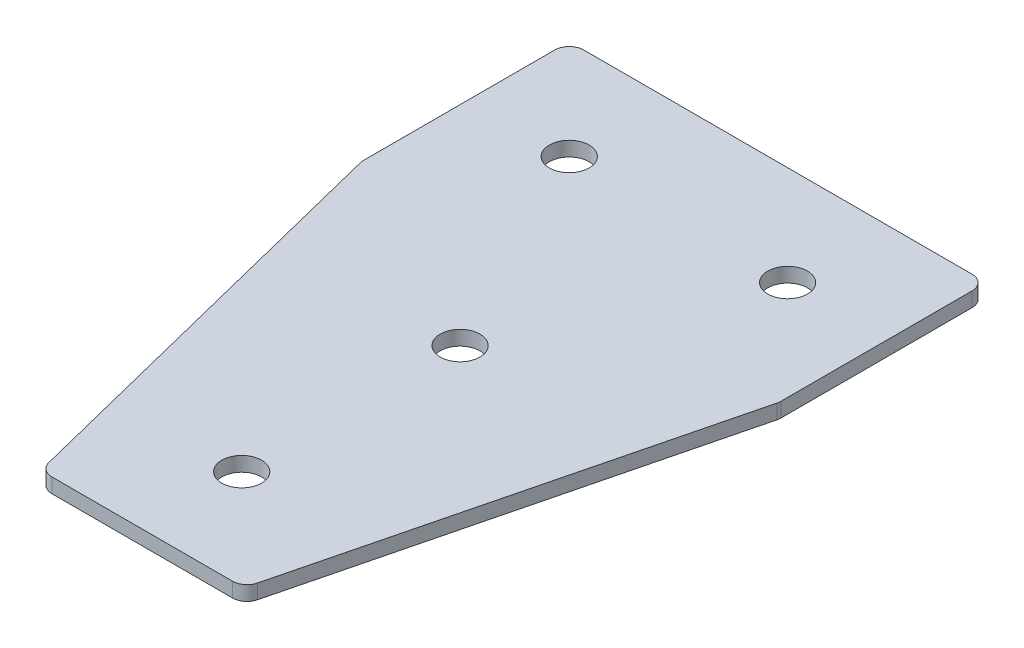
ISO-10303-21;
HEADER;
FILE_DESCRIPTION(('STEP AP214'),'2;1');
FILE_NAME('part.step','',(''),(''),'','','');
FILE_SCHEMA(('AUTOMOTIVE_DESIGN { 1 0 10303 214 1 1 1 1 }'));
ENDSEC;
DATA;
#1=APPLICATION_CONTEXT('core data for automotive mechanical design processes');
#2=APPLICATION_PROTOCOL_DEFINITION('international standard','automotive_design',2000,#1);
#3=PRODUCT_CONTEXT('',#1,'mechanical');
#4=PRODUCT('Part','Part','',(#3));
#5=PRODUCT_RELATED_PRODUCT_CATEGORY('part','',(#4));
#6=PRODUCT_DEFINITION_FORMATION('','',#4);
#7=PRODUCT_DEFINITION_CONTEXT('part definition',#1,'design');
#8=PRODUCT_DEFINITION('design','',#6,#7);
#9=PRODUCT_DEFINITION_SHAPE('','',#8);
#10=(LENGTH_UNIT() NAMED_UNIT(*) SI_UNIT(.MILLI.,.METRE.));
#11=(NAMED_UNIT(*) PLANE_ANGLE_UNIT() SI_UNIT($,.RADIAN.));
#12=(NAMED_UNIT(*) SI_UNIT($,.STERADIAN.) SOLID_ANGLE_UNIT());
#13=UNCERTAINTY_MEASURE_WITH_UNIT(LENGTH_MEASURE(1.E-05),#10,'distance_accuracy_value','');
#14=(GEOMETRIC_REPRESENTATION_CONTEXT(3) GLOBAL_UNCERTAINTY_ASSIGNED_CONTEXT((#13)) GLOBAL_UNIT_ASSIGNED_CONTEXT((#10,
#11,#12)) REPRESENTATION_CONTEXT('',''));
#15=CARTESIAN_POINT('',(0.,0.,0.));
#16=DIRECTION('',(0.,0.,1.));
#17=DIRECTION('',(1.,0.,0.));
#18=AXIS2_PLACEMENT_3D('',#15,#16,#17);
#19=CARTESIAN_POINT('',(-1.3162117550678,0.55807034319605,-45.7415241212243));
#20=DIRECTION('',(0.,-1.,0.));
#21=DIRECTION('',(0.,0.,-1.));
#22=AXIS2_PLACEMENT_3D('',#19,#20,#21);
#23=PLANE('',#22);
#24=CARTESIAN_POINT('',(-1.31621175506781,0.55807034319605,-0.741524121224274));
#25=DIRECTION('',(0.,1.,0.));
#26=DIRECTION('',(0.,0.,1.));
#27=AXIS2_PLACEMENT_3D('',#24,#25,#26);
#28=CIRCLE('',#27,4.1);
#29=CARTESIAN_POINT('',(-1.31621175506781,0.55807034319605,3.35847587877573));
#30=VERTEX_POINT('',#29);
#31=EDGE_CURVE('E171',#30,#30,#28,.T.);
#32=ORIENTED_EDGE('',*,*,#31,.T.);
#33=EDGE_LOOP('',(#32));
#34=FACE_BOUND('',#33,.T.);
#35=DIRECTION('',(1.,0.,0.));
#36=VECTOR('',#35,1.);
#37=CARTESIAN_POINT('',(-21.8162117550678,0.55807034319605,64.7584758787757));
#38=LINE('',#37,#36);
#39=CARTESIAN_POINT('',(-19.9123297230457,0.55807034319605,64.7584758787757));
#40=VERTEX_POINT('',#39);
#41=CARTESIAN_POINT('',(17.2799062129101,0.55807034319605,64.7584758787757));
#42=VERTEX_POINT('',#41);
#43=EDGE_CURVE('E189',#40,#42,#38,.T.);
#44=ORIENTED_EDGE('',*,*,#43,.F.);
#45=CARTESIAN_POINT('',(-19.9123297230457,0.55807034319605,61.7584758787757));
#46=DIRECTION('',(0.,1.,0.));
#47=DIRECTION('',(0.,0.,-1.));
#48=AXIS2_PLACEMENT_3D('',#45,#46,#47);
#49=CIRCLE('',#48,3.);
#50=CARTESIAN_POINT('',(-22.8227572234817,0.55807034319605,62.4860827538847));
#51=VERTEX_POINT('',#50);
#52=EDGE_CURVE('E155',#51,#40,#49,.T.);
#53=ORIENTED_EDGE('',*,*,#52,.F.);
#54=DIRECTION('',(-0.242535625036334,0.,-0.970142500145332));
#55=VECTOR('',#54,1.);
#56=CARTESIAN_POINT('',(-22.2546589422589,0.55807034319605,64.7584758787757));
#57=LINE('',#56,#55);
#58=CARTESIAN_POINT('',(-44.2266392555038,0.55807034319605,-23.1294453742035));
#59=VERTEX_POINT('',#58);
#60=EDGE_CURVE('E142',#51,#59,#57,.T.);
#61=ORIENTED_EDGE('',*,*,#60,.T.);
#62=CARTESIAN_POINT('',(-41.3162117550678,0.55807034319605,-23.8570522493125));
#63=DIRECTION('',(0.,1.,0.));
#64=DIRECTION('',(0.,0.,-1.));
#65=AXIS2_PLACEMENT_3D('',#62,#63,#64);
#66=CIRCLE('',#65,3.);
#67=CARTESIAN_POINT('',(-44.3162117550678,0.55807034319605,-23.8570522493125));
#68=VERTEX_POINT('',#67);
#69=EDGE_CURVE('E153',#68,#59,#66,.T.);
#70=ORIENTED_EDGE('',*,*,#69,.F.);
#71=DIRECTION('',(0.,0.,-1.));
#72=VECTOR('',#71,1.);
#73=CARTESIAN_POINT('',(-44.3162117550678,0.55807034319605,-23.4877353724595));
#74=LINE('',#73,#72);
#75=CARTESIAN_POINT('',(-44.3162117550678,0.55807034319605,-63.2415241212243));
#76=VERTEX_POINT('',#75);
#77=EDGE_CURVE('E124',#68,#76,#74,.T.);
#78=ORIENTED_EDGE('',*,*,#77,.T.);
#79=CARTESIAN_POINT('',(-41.3162117550678,0.55807034319605,-63.2415241212243));
#80=DIRECTION('',(0.,1.,0.));
#81=DIRECTION('',(0.,0.,-1.));
#82=AXIS2_PLACEMENT_3D('',#79,#80,#81);
#83=CIRCLE('',#82,3.);
#84=CARTESIAN_POINT('',(-41.3162117550678,0.55807034319605,-66.2415241212243));
#85=VERTEX_POINT('',#84);
#86=EDGE_CURVE('E150',#85,#76,#83,.T.);
#87=ORIENTED_EDGE('',*,*,#86,.F.);
#88=DIRECTION('',(-1.,0.,0.));
#89=VECTOR('',#88,1.);
#90=CARTESIAN_POINT('',(41.6837882449322,0.55807034319605,-66.2415241212243));
#91=LINE('',#90,#89);
#92=CARTESIAN_POINT('',(38.6837882449322,0.55807034319605,-66.2415241212243));
#93=VERTEX_POINT('',#92);
#94=EDGE_CURVE('E186',#93,#85,#91,.T.);
#95=ORIENTED_EDGE('',*,*,#94,.F.);
#96=CARTESIAN_POINT('',(38.6837882449322,0.55807034319605,-63.2415241212243));
#97=DIRECTION('',(0.,-1.,0.));
#98=DIRECTION('',(0.,0.,-1.));
#99=AXIS2_PLACEMENT_3D('',#96,#97,#98);
#100=CIRCLE('',#99,3.);
#101=CARTESIAN_POINT('',(41.6837882449322,0.55807034319605,-63.2415241212243));
#102=VERTEX_POINT('',#101);
#103=EDGE_CURVE('E210',#93,#102,#100,.T.);
#104=ORIENTED_EDGE('',*,*,#103,.T.);
#105=DIRECTION('',(0.,0.,-1.));
#106=VECTOR('',#105,1.);
#107=CARTESIAN_POINT('',(41.6837882449322,0.55807034319605,-23.4877353724595));
#108=LINE('',#107,#106);
#109=CARTESIAN_POINT('',(41.6837882449322,0.55807034319605,-23.8570522493125));
#110=VERTEX_POINT('',#109);
#111=EDGE_CURVE('E183',#110,#102,#108,.T.);
#112=ORIENTED_EDGE('',*,*,#111,.F.);
#113=CARTESIAN_POINT('',(38.6837882449322,0.55807034319605,-23.8570522493125));
#114=DIRECTION('',(0.,-1.,0.));
#115=DIRECTION('',(0.,0.,-1.));
#116=AXIS2_PLACEMENT_3D('',#113,#114,#115);
#117=CIRCLE('',#116,3.);
#118=CARTESIAN_POINT('',(41.5942157453682,0.55807034319605,-23.1294453742035));
#119=VERTEX_POINT('',#118);
#120=EDGE_CURVE('E31',#110,#119,#117,.T.);
#121=ORIENTED_EDGE('',*,*,#120,.T.);
#122=DIRECTION('',(0.242535625036333,0.,-0.970142500145332));
#123=VECTOR('',#122,1.);
#124=CARTESIAN_POINT('',(19.6222354321234,0.55807034319605,64.7584758787757));
#125=LINE('',#124,#123);
#126=CARTESIAN_POINT('',(20.1903337133461,0.55807034319605,62.4860827538847));
#127=VERTEX_POINT('',#126);
#128=EDGE_CURVE('E191',#127,#119,#125,.T.);
#129=ORIENTED_EDGE('',*,*,#128,.F.);
#130=CARTESIAN_POINT('',(17.2799062129101,0.55807034319605,61.7584758787757));
#131=DIRECTION('',(0.,-1.,0.));
#132=DIRECTION('',(0.,0.,-1.));
#133=AXIS2_PLACEMENT_3D('',#130,#131,#132);
#134=CIRCLE('',#133,3.);
#135=EDGE_CURVE('E213',#127,#42,#134,.T.);
#136=ORIENTED_EDGE('',*,*,#135,.T.);
#137=EDGE_LOOP('',(#44,#53,#61,#70,#78,#87,#95,#104,#112,#121,#129,#136));
#138=FACE_BOUND('',#137,.T.);
#139=CARTESIAN_POINT('',(-1.31621175506781,0.55807034319605,44.2584758787757));
#140=DIRECTION('',(0.,1.,0.));
#141=DIRECTION('',(0.,0.,1.));
#142=AXIS2_PLACEMENT_3D('',#139,#140,#141);
#143=CIRCLE('',#142,4.1);
#144=CARTESIAN_POINT('',(-1.31621175506781,0.55807034319605,48.3584758787757));
#145=VERTEX_POINT('',#144);
#146=EDGE_CURVE('E165',#145,#145,#143,.T.);
#147=ORIENTED_EDGE('',*,*,#146,.T.);
#148=EDGE_LOOP('',(#147));
#149=FACE_BOUND('',#148,.T.);
#150=CARTESIAN_POINT('',(21.1837882449322,0.55807034319605,-45.7415241212243));
#151=DIRECTION('',(0.,1.,0.));
#152=DIRECTION('',(0.,0.,1.));
#153=AXIS2_PLACEMENT_3D('',#150,#151,#152);
#154=CIRCLE('',#153,4.1);
#155=CARTESIAN_POINT('',(21.1837882449322,0.55807034319605,-41.6415241212243));
#156=VERTEX_POINT('',#155);
#157=EDGE_CURVE('E177',#156,#156,#154,.T.);
#158=ORIENTED_EDGE('',*,*,#157,.T.);
#159=EDGE_LOOP('',(#158));
#160=FACE_BOUND('',#159,.T.);
#161=CARTESIAN_POINT('',(-23.8162117550678,0.55807034319605,-45.7415241212243));
#162=DIRECTION('',(0.,-1.,0.));
#163=DIRECTION('',(0.,0.,1.));
#164=AXIS2_PLACEMENT_3D('',#161,#162,#163);
#165=CIRCLE('',#164,4.1);
#166=CARTESIAN_POINT('',(-23.8162117550678,0.55807034319605,-41.6415241212243));
#167=VERTEX_POINT('',#166);
#168=EDGE_CURVE('E135',#167,#167,#165,.T.);
#169=ORIENTED_EDGE('',*,*,#168,.F.);
#170=EDGE_LOOP('',(#169));
#171=FACE_BOUND('',#170,.T.);
#172=ADVANCED_FACE('F16',(#34,#138,#149,#160,#171),#23,.T.);
#173=CARTESIAN_POINT('',(41.6837882449322,0.55807034319605,-23.4877353724595));
#174=DIRECTION('',(1.,0.,0.));
#175=DIRECTION('',(0.,0.,-1.));
#176=AXIS2_PLACEMENT_3D('',#173,#174,#175);
#177=PLANE('',#176);
#178=DIRECTION('',(0.,0.,-1.));
#179=VECTOR('',#178,1.);
#180=CARTESIAN_POINT('',(41.6837882449322,3.55807034319605,-23.4877353724595));
#181=LINE('',#180,#179);
#182=CARTESIAN_POINT('',(41.6837882449322,3.55807034319605,-23.8570522493125));
#183=VERTEX_POINT('',#182);
#184=CARTESIAN_POINT('',(41.6837882449322,3.55807034319605,-63.2415241212243));
#185=VERTEX_POINT('',#184);
#186=EDGE_CURVE('E180',#183,#185,#181,.T.);
#187=ORIENTED_EDGE('',*,*,#186,.F.);
#188=DIRECTION('',(0.,1.,0.));
#189=VECTOR('',#188,1.);
#190=CARTESIAN_POINT('',(41.6837882449322,0.55807034319605,-23.8570522493125));
#191=LINE('',#190,#189);
#192=EDGE_CURVE('E24',#183,#110,#191,.F.);
#193=ORIENTED_EDGE('',*,*,#192,.T.);
#194=ORIENTED_EDGE('',*,*,#111,.T.);
#195=DIRECTION('',(0.,1.,0.));
#196=VECTOR('',#195,1.);
#197=CARTESIAN_POINT('',(41.6837882449322,0.55807034319605,-63.2415241212243));
#198=LINE('',#197,#196);
#199=EDGE_CURVE('E220',#102,#185,#198,.T.);
#200=ORIENTED_EDGE('',*,*,#199,.T.);
#201=EDGE_LOOP('',(#187,#193,#194,#200));
#202=FACE_BOUND('',#201,.T.);
#203=ADVANCED_FACE('F225',(#202),#177,.T.);
#204=CARTESIAN_POINT('',(19.6222354321234,0.55807034319605,64.7584758787757));
#205=DIRECTION('',(0.970142500145332,0.,0.242535625036333));
#206=DIRECTION('',(0.242535625036333,0.,-0.970142500145332));
#207=AXIS2_PLACEMENT_3D('',#204,#205,#206);
#208=PLANE('',#207);
#209=DIRECTION('',(0.242535625036333,0.,-0.970142500145332));
#210=VECTOR('',#209,1.);
#211=CARTESIAN_POINT('',(19.6222354321234,3.55807034319605,64.7584758787757));
#212=LINE('',#211,#210);
#213=CARTESIAN_POINT('',(20.1903337133461,3.55807034319605,62.4860827538847));
#214=VERTEX_POINT('',#213);
#215=CARTESIAN_POINT('',(41.5942157453682,3.55807034319605,-23.1294453742035));
#216=VERTEX_POINT('',#215);
#217=EDGE_CURVE('E187',#214,#216,#212,.T.);
#218=ORIENTED_EDGE('',*,*,#217,.F.);
#219=DIRECTION('',(0.,1.,0.));
#220=VECTOR('',#219,1.);
#221=CARTESIAN_POINT('',(20.1903337133461,0.55807034319605,62.4860827538847));
#222=LINE('',#221,#220);
#223=EDGE_CURVE('E38',#214,#127,#222,.F.);
#224=ORIENTED_EDGE('',*,*,#223,.T.);
#225=ORIENTED_EDGE('',*,*,#128,.T.);
#226=DIRECTION('',(0.,1.,0.));
#227=VECTOR('',#226,1.);
#228=CARTESIAN_POINT('',(41.5942157453682,0.55807034319605,-23.1294453742035));
#229=LINE('',#228,#227);
#230=EDGE_CURVE('E216',#119,#216,#229,.T.);
#231=ORIENTED_EDGE('',*,*,#230,.T.);
#232=EDGE_LOOP('',(#218,#224,#225,#231));
#233=FACE_BOUND('',#232,.T.);
#234=ADVANCED_FACE('F233',(#233),#208,.T.);
#235=CARTESIAN_POINT('',(-21.8162117550678,0.55807034319605,64.7584758787757));
#236=DIRECTION('',(0.,0.,1.));
#237=DIRECTION('',(1.,0.,0.));
#238=AXIS2_PLACEMENT_3D('',#235,#236,#237);
#239=PLANE('',#238);
#240=DIRECTION('',(1.,0.,0.));
#241=VECTOR('',#240,1.);
#242=CARTESIAN_POINT('',(-21.8162117550678,3.55807034319605,64.7584758787757));
#243=LINE('',#242,#241);
#244=CARTESIAN_POINT('',(-19.9123297230457,3.55807034319605,64.7584758787757));
#245=VERTEX_POINT('',#244);
#246=CARTESIAN_POINT('',(17.2799062129101,3.55807034319605,64.7584758787757));
#247=VERTEX_POINT('',#246);
#248=EDGE_CURVE('E198',#245,#247,#243,.T.);
#249=ORIENTED_EDGE('',*,*,#248,.F.);
#250=DIRECTION('',(0.,1.,0.));
#251=VECTOR('',#250,1.);
#252=CARTESIAN_POINT('',(-19.9123297230457,0.55807034319605,64.7584758787757));
#253=LINE('',#252,#251);
#254=EDGE_CURVE('E147',#40,#245,#253,.T.);
#255=ORIENTED_EDGE('',*,*,#254,.F.);
#256=ORIENTED_EDGE('',*,*,#43,.T.);
#257=DIRECTION('',(0.,1.,0.));
#258=VECTOR('',#257,1.);
#259=CARTESIAN_POINT('',(17.2799062129101,0.55807034319605,64.7584758787757));
#260=LINE('',#259,#258);
#261=EDGE_CURVE('E207',#42,#247,#260,.T.);
#262=ORIENTED_EDGE('',*,*,#261,.T.);
#263=EDGE_LOOP('',(#249,#255,#256,#262));
#264=FACE_BOUND('',#263,.T.);
#265=ADVANCED_FACE('F240',(#264),#239,.T.);
#266=CARTESIAN_POINT('',(41.6837882449322,0.55807034319605,-66.2415241212243));
#267=DIRECTION('',(0.,0.,-1.));
#268=DIRECTION('',(-1.,0.,0.));
#269=AXIS2_PLACEMENT_3D('',#266,#267,#268);
#270=PLANE('',#269);
#271=ORIENTED_EDGE('',*,*,#94,.T.);
#272=DIRECTION('',(0.,1.,0.));
#273=VECTOR('',#272,1.);
#274=CARTESIAN_POINT('',(-41.3162117550678,0.55807034319605,-66.2415241212243));
#275=LINE('',#274,#273);
#276=CARTESIAN_POINT('',(-41.3162117550678,3.55807034319605,-66.2415241212243));
#277=VERTEX_POINT('',#276);
#278=EDGE_CURVE('E126',#277,#85,#275,.F.);
#279=ORIENTED_EDGE('',*,*,#278,.F.);
#280=DIRECTION('',(-1.,0.,0.));
#281=VECTOR('',#280,1.);
#282=CARTESIAN_POINT('',(41.6837882449322,3.55807034319605,-66.2415241212243));
#283=LINE('',#282,#281);
#284=CARTESIAN_POINT('',(38.6837882449322,3.55807034319605,-66.2415241212243));
#285=VERTEX_POINT('',#284);
#286=EDGE_CURVE('E196',#285,#277,#283,.T.);
#287=ORIENTED_EDGE('',*,*,#286,.F.);
#288=DIRECTION('',(0.,1.,0.));
#289=VECTOR('',#288,1.);
#290=CARTESIAN_POINT('',(38.6837882449322,0.55807034319605,-66.2415241212243));
#291=LINE('',#290,#289);
#292=EDGE_CURVE('E10',#285,#93,#291,.F.);
#293=ORIENTED_EDGE('',*,*,#292,.T.);
#294=EDGE_LOOP('',(#271,#279,#287,#293));
#295=FACE_BOUND('',#294,.T.);
#296=ADVANCED_FACE('F294',(#295),#270,.T.);
#297=CARTESIAN_POINT('',(-1.3162117550678,3.55807034319605,-45.7415241212243));
#298=DIRECTION('',(0.,-1.,0.));
#299=DIRECTION('',(0.,0.,-1.));
#300=AXIS2_PLACEMENT_3D('',#297,#298,#299);
#301=PLANE('',#300);
#302=CARTESIAN_POINT('',(-1.31621175506781,3.55807034319605,-0.741524121224274));
#303=DIRECTION('',(0.,1.,0.));
#304=DIRECTION('',(0.,0.,1.));
#305=AXIS2_PLACEMENT_3D('',#302,#303,#304);
#306=CIRCLE('',#305,4.1);
#307=CARTESIAN_POINT('',(-1.31621175506781,3.55807034319605,3.35847587877573));
#308=VERTEX_POINT('',#307);
#309=EDGE_CURVE('E168',#308,#308,#306,.T.);
#310=ORIENTED_EDGE('',*,*,#309,.F.);
#311=EDGE_LOOP('',(#310));
#312=FACE_BOUND('',#311,.T.);
#313=CARTESIAN_POINT('',(-19.9123297230457,3.55807034319605,61.7584758787757));
#314=DIRECTION('',(0.,1.,0.));
#315=DIRECTION('',(0.,0.,-1.));
#316=AXIS2_PLACEMENT_3D('',#313,#314,#315);
#317=CIRCLE('',#316,3.);
#318=CARTESIAN_POINT('',(-22.8227572234817,3.55807034319605,62.4860827538847));
#319=VERTEX_POINT('',#318);
#320=EDGE_CURVE('E116',#245,#319,#317,.F.);
#321=ORIENTED_EDGE('',*,*,#320,.F.);
#322=ORIENTED_EDGE('',*,*,#248,.T.);
#323=CARTESIAN_POINT('',(17.2799062129101,3.55807034319605,61.7584758787757));
#324=DIRECTION('',(0.,-1.,0.));
#325=DIRECTION('',(0.,0.,-1.));
#326=AXIS2_PLACEMENT_3D('',#323,#324,#325);
#327=CIRCLE('',#326,3.);
#328=EDGE_CURVE('E205',#247,#214,#327,.F.);
#329=ORIENTED_EDGE('',*,*,#328,.T.);
#330=ORIENTED_EDGE('',*,*,#217,.T.);
#331=CARTESIAN_POINT('',(38.6837882449322,3.55807034319605,-23.8570522493125));
#332=DIRECTION('',(0.,-1.,0.));
#333=DIRECTION('',(0.,0.,-1.));
#334=AXIS2_PLACEMENT_3D('',#331,#332,#333);
#335=CIRCLE('',#334,3.);
#336=EDGE_CURVE('E203',#216,#183,#335,.F.);
#337=ORIENTED_EDGE('',*,*,#336,.T.);
#338=ORIENTED_EDGE('',*,*,#186,.T.);
#339=CARTESIAN_POINT('',(38.6837882449322,3.55807034319605,-63.2415241212243));
#340=DIRECTION('',(0.,-1.,0.));
#341=DIRECTION('',(0.,0.,-1.));
#342=AXIS2_PLACEMENT_3D('',#339,#340,#341);
#343=CIRCLE('',#342,3.);
#344=EDGE_CURVE('E193',#185,#285,#343,.F.);
#345=ORIENTED_EDGE('',*,*,#344,.T.);
#346=ORIENTED_EDGE('',*,*,#286,.T.);
#347=CARTESIAN_POINT('',(-41.3162117550678,3.55807034319605,-63.2415241212243));
#348=DIRECTION('',(0.,1.,0.));
#349=DIRECTION('',(0.,0.,-1.));
#350=AXIS2_PLACEMENT_3D('',#347,#348,#349);
#351=CIRCLE('',#350,3.);
#352=CARTESIAN_POINT('',(-44.3162117550678,3.55807034319605,-63.2415241212243));
#353=VERTEX_POINT('',#352);
#354=EDGE_CURVE('E117',#353,#277,#351,.F.);
#355=ORIENTED_EDGE('',*,*,#354,.F.);
#356=DIRECTION('',(0.,0.,-1.));
#357=VECTOR('',#356,1.);
#358=CARTESIAN_POINT('',(-44.3162117550678,3.55807034319605,-23.4877353724595));
#359=LINE('',#358,#357);
#360=CARTESIAN_POINT('',(-44.3162117550678,3.55807034319605,-23.8570522493125));
#361=VERTEX_POINT('',#360);
#362=EDGE_CURVE('E122',#361,#353,#359,.T.);
#363=ORIENTED_EDGE('',*,*,#362,.F.);
#364=CARTESIAN_POINT('',(-41.3162117550678,3.55807034319605,-23.8570522493125));
#365=DIRECTION('',(0.,1.,0.));
#366=DIRECTION('',(0.,0.,-1.));
#367=AXIS2_PLACEMENT_3D('',#364,#365,#366);
#368=CIRCLE('',#367,3.);
#369=CARTESIAN_POINT('',(-44.2266392555038,3.55807034319605,-23.1294453742035));
#370=VERTEX_POINT('',#369);
#371=EDGE_CURVE('E105',#370,#361,#368,.F.);
#372=ORIENTED_EDGE('',*,*,#371,.F.);
#373=DIRECTION('',(-0.242535625036334,0.,-0.970142500145332));
#374=VECTOR('',#373,1.);
#375=CARTESIAN_POINT('',(-22.2546589422589,3.55807034319605,64.7584758787757));
#376=LINE('',#375,#374);
#377=EDGE_CURVE('E134',#319,#370,#376,.T.);
#378=ORIENTED_EDGE('',*,*,#377,.F.);
#379=EDGE_LOOP('',(#321,#322,#329,#330,#337,#338,#345,#346,#355,#363,#372,#378));
#380=FACE_BOUND('',#379,.T.);
#381=CARTESIAN_POINT('',(-1.31621175506781,3.55807034319605,44.2584758787757));
#382=DIRECTION('',(0.,1.,0.));
#383=DIRECTION('',(0.,0.,1.));
#384=AXIS2_PLACEMENT_3D('',#381,#382,#383);
#385=CIRCLE('',#384,4.1);
#386=CARTESIAN_POINT('',(-1.31621175506781,3.55807034319605,48.3584758787757));
#387=VERTEX_POINT('',#386);
#388=EDGE_CURVE('E164',#387,#387,#385,.T.);
#389=ORIENTED_EDGE('',*,*,#388,.F.);
#390=EDGE_LOOP('',(#389));
#391=FACE_BOUND('',#390,.T.);
#392=CARTESIAN_POINT('',(21.1837882449322,3.55807034319605,-45.7415241212243));
#393=DIRECTION('',(0.,1.,0.));
#394=DIRECTION('',(0.,0.,1.));
#395=AXIS2_PLACEMENT_3D('',#392,#393,#394);
#396=CIRCLE('',#395,4.1);
#397=CARTESIAN_POINT('',(21.1837882449322,3.55807034319605,-41.6415241212243));
#398=VERTEX_POINT('',#397);
#399=EDGE_CURVE('E174',#398,#398,#396,.T.);
#400=ORIENTED_EDGE('',*,*,#399,.F.);
#401=EDGE_LOOP('',(#400));
#402=FACE_BOUND('',#401,.T.);
#403=CARTESIAN_POINT('',(-23.8162117550678,3.55807034319605,-45.7415241212243));
#404=DIRECTION('',(0.,-1.,0.));
#405=DIRECTION('',(0.,0.,1.));
#406=AXIS2_PLACEMENT_3D('',#403,#404,#405);
#407=CIRCLE('',#406,4.1);
#408=CARTESIAN_POINT('',(-23.8162117550678,3.55807034319605,-41.6415241212243));
#409=VERTEX_POINT('',#408);
#410=EDGE_CURVE('E139',#409,#409,#407,.T.);
#411=ORIENTED_EDGE('',*,*,#410,.T.);
#412=EDGE_LOOP('',(#411));
#413=FACE_BOUND('',#412,.T.);
#414=ADVANCED_FACE('F130',(#312,#380,#391,#402,#413),#301,.F.);
#415=CARTESIAN_POINT('',(17.2799062129101,0.55807034319605,61.7584758787757));
#416=DIRECTION('',(0.,1.,0.));
#417=DIRECTION('',(0.,0.,1.));
#418=AXIS2_PLACEMENT_3D('',#415,#416,#417);
#419=CYLINDRICAL_SURFACE('',#418,3.);
#420=ORIENTED_EDGE('',*,*,#135,.F.);
#421=ORIENTED_EDGE('',*,*,#223,.F.);
#422=ORIENTED_EDGE('',*,*,#328,.F.);
#423=ORIENTED_EDGE('',*,*,#261,.F.);
#424=EDGE_LOOP('',(#420,#421,#422,#423));
#425=FACE_BOUND('',#424,.T.);
#426=ADVANCED_FACE('F238',(#425),#419,.T.);
#427=CARTESIAN_POINT('',(38.6837882449322,0.55807034319605,-23.8570522493125));
#428=DIRECTION('',(0.,1.,0.));
#429=DIRECTION('',(0.,0.,1.));
#430=AXIS2_PLACEMENT_3D('',#427,#428,#429);
#431=CYLINDRICAL_SURFACE('',#430,3.);
#432=ORIENTED_EDGE('',*,*,#120,.F.);
#433=ORIENTED_EDGE('',*,*,#192,.F.);
#434=ORIENTED_EDGE('',*,*,#336,.F.);
#435=ORIENTED_EDGE('',*,*,#230,.F.);
#436=EDGE_LOOP('',(#432,#433,#434,#435));
#437=FACE_BOUND('',#436,.T.);
#438=ADVANCED_FACE('F232',(#437),#431,.T.);
#439=CARTESIAN_POINT('',(38.6837882449322,0.55807034319605,-63.2415241212243));
#440=DIRECTION('',(0.,1.,0.));
#441=DIRECTION('',(0.,0.,1.));
#442=AXIS2_PLACEMENT_3D('',#439,#440,#441);
#443=CYLINDRICAL_SURFACE('',#442,3.);
#444=ORIENTED_EDGE('',*,*,#103,.F.);
#445=ORIENTED_EDGE('',*,*,#292,.F.);
#446=ORIENTED_EDGE('',*,*,#344,.F.);
#447=ORIENTED_EDGE('',*,*,#199,.F.);
#448=EDGE_LOOP('',(#444,#445,#446,#447));
#449=FACE_BOUND('',#448,.T.);
#450=ADVANCED_FACE('F18',(#449),#443,.T.);
#451=CARTESIAN_POINT('',(21.1837882449322,0.55807034319605,-45.7415241212243));
#452=DIRECTION('',(0.,1.,0.));
#453=DIRECTION('',(0.,0.,1.));
#454=AXIS2_PLACEMENT_3D('',#451,#452,#453);
#455=CYLINDRICAL_SURFACE('',#454,4.1);
#456=ORIENTED_EDGE('',*,*,#157,.F.);
#457=EDGE_LOOP('',(#456));
#458=FACE_BOUND('',#457,.T.);
#459=ORIENTED_EDGE('',*,*,#399,.T.);
#460=EDGE_LOOP('',(#459));
#461=FACE_BOUND('',#460,.T.);
#462=ADVANCED_FACE('F282',(#458,#461),#455,.F.);
#463=CARTESIAN_POINT('',(-1.31621175506781,0.55807034319605,-0.741524121224274));
#464=DIRECTION('',(0.,1.,0.));
#465=DIRECTION('',(0.,0.,1.));
#466=AXIS2_PLACEMENT_3D('',#463,#464,#465);
#467=CYLINDRICAL_SURFACE('',#466,4.1);
#468=ORIENTED_EDGE('',*,*,#31,.F.);
#469=EDGE_LOOP('',(#468));
#470=FACE_BOUND('',#469,.T.);
#471=ORIENTED_EDGE('',*,*,#309,.T.);
#472=EDGE_LOOP('',(#471));
#473=FACE_BOUND('',#472,.T.);
#474=ADVANCED_FACE('F287',(#470,#473),#467,.F.);
#475=CARTESIAN_POINT('',(-1.31621175506781,0.55807034319605,44.2584758787757));
#476=DIRECTION('',(0.,1.,0.));
#477=DIRECTION('',(0.,0.,1.));
#478=AXIS2_PLACEMENT_3D('',#475,#476,#477);
#479=CYLINDRICAL_SURFACE('',#478,4.1);
#480=ORIENTED_EDGE('',*,*,#388,.T.);
#481=EDGE_LOOP('',(#480));
#482=FACE_BOUND('',#481,.T.);
#483=ORIENTED_EDGE('',*,*,#146,.F.);
#484=EDGE_LOOP('',(#483));
#485=FACE_BOUND('',#484,.T.);
#486=ADVANCED_FACE('F308',(#482,#485),#479,.F.);
#487=CARTESIAN_POINT('',(-44.3162117550678,0.55807034319605,-23.4877353724595));
#488=DIRECTION('',(-1.,0.,0.));
#489=DIRECTION('',(0.,0.,-1.));
#490=AXIS2_PLACEMENT_3D('',#487,#488,#489);
#491=PLANE('',#490);
#492=ORIENTED_EDGE('',*,*,#362,.T.);
#493=DIRECTION('',(0.,1.,0.));
#494=VECTOR('',#493,1.);
#495=CARTESIAN_POINT('',(-44.3162117550678,0.55807034319605,-63.2415241212243));
#496=LINE('',#495,#494);
#497=EDGE_CURVE('E127',#76,#353,#496,.T.);
#498=ORIENTED_EDGE('',*,*,#497,.F.);
#499=ORIENTED_EDGE('',*,*,#77,.F.);
#500=DIRECTION('',(0.,1.,0.));
#501=VECTOR('',#500,1.);
#502=CARTESIAN_POINT('',(-44.3162117550678,0.55807034319605,-23.8570522493125));
#503=LINE('',#502,#501);
#504=EDGE_CURVE('E109',#361,#68,#503,.F.);
#505=ORIENTED_EDGE('',*,*,#504,.F.);
#506=EDGE_LOOP('',(#492,#498,#499,#505));
#507=FACE_BOUND('',#506,.T.);
#508=ADVANCED_FACE('F121',(#507),#491,.T.);
#509=CARTESIAN_POINT('',(-22.2546589422589,0.55807034319605,64.7584758787757));
#510=DIRECTION('',(-0.970142500145332,0.,0.242535625036334));
#511=DIRECTION('',(-0.242535625036334,0.,-0.970142500145332));
#512=AXIS2_PLACEMENT_3D('',#509,#510,#511);
#513=PLANE('',#512);
#514=ORIENTED_EDGE('',*,*,#377,.T.);
#515=DIRECTION('',(0.,1.,0.));
#516=VECTOR('',#515,1.);
#517=CARTESIAN_POINT('',(-44.2266392555038,0.55807034319605,-23.1294453742035));
#518=LINE('',#517,#516);
#519=EDGE_CURVE('E111',#59,#370,#518,.T.);
#520=ORIENTED_EDGE('',*,*,#519,.F.);
#521=ORIENTED_EDGE('',*,*,#60,.F.);
#522=DIRECTION('',(0.,1.,0.));
#523=VECTOR('',#522,1.);
#524=CARTESIAN_POINT('',(-22.8227572234817,0.55807034319605,62.4860827538847));
#525=LINE('',#524,#523);
#526=EDGE_CURVE('E159',#319,#51,#525,.F.);
#527=ORIENTED_EDGE('',*,*,#526,.F.);
#528=EDGE_LOOP('',(#514,#520,#521,#527));
#529=FACE_BOUND('',#528,.T.);
#530=ADVANCED_FACE('F249',(#529),#513,.T.);
#531=CARTESIAN_POINT('',(-19.9123297230457,0.55807034319605,61.7584758787757));
#532=DIRECTION('',(0.,1.,0.));
#533=DIRECTION('',(0.,0.,1.));
#534=AXIS2_PLACEMENT_3D('',#531,#532,#533);
#535=CYLINDRICAL_SURFACE('',#534,3.);
#536=ORIENTED_EDGE('',*,*,#52,.T.);
#537=ORIENTED_EDGE('',*,*,#254,.T.);
#538=ORIENTED_EDGE('',*,*,#320,.T.);
#539=ORIENTED_EDGE('',*,*,#526,.T.);
#540=EDGE_LOOP('',(#536,#537,#538,#539));
#541=FACE_BOUND('',#540,.T.);
#542=ADVANCED_FACE('F246',(#541),#535,.T.);
#543=CARTESIAN_POINT('',(-41.3162117550678,0.55807034319605,-23.8570522493125));
#544=DIRECTION('',(0.,1.,0.));
#545=DIRECTION('',(0.,0.,1.));
#546=AXIS2_PLACEMENT_3D('',#543,#544,#545);
#547=CYLINDRICAL_SURFACE('',#546,3.);
#548=ORIENTED_EDGE('',*,*,#69,.T.);
#549=ORIENTED_EDGE('',*,*,#519,.T.);
#550=ORIENTED_EDGE('',*,*,#371,.T.);
#551=ORIENTED_EDGE('',*,*,#504,.T.);
#552=EDGE_LOOP('',(#548,#549,#550,#551));
#553=FACE_BOUND('',#552,.T.);
#554=ADVANCED_FACE('F108',(#553),#547,.T.);
#555=CARTESIAN_POINT('',(-41.3162117550678,0.55807034319605,-63.2415241212243));
#556=DIRECTION('',(0.,1.,0.));
#557=DIRECTION('',(0.,0.,1.));
#558=AXIS2_PLACEMENT_3D('',#555,#556,#557);
#559=CYLINDRICAL_SURFACE('',#558,3.);
#560=ORIENTED_EDGE('',*,*,#86,.T.);
#561=ORIENTED_EDGE('',*,*,#497,.T.);
#562=ORIENTED_EDGE('',*,*,#354,.T.);
#563=ORIENTED_EDGE('',*,*,#278,.T.);
#564=EDGE_LOOP('',(#560,#561,#562,#563));
#565=FACE_BOUND('',#564,.T.);
#566=ADVANCED_FACE('F258',(#565),#559,.T.);
#567=CARTESIAN_POINT('',(-23.8162117550678,0.55807034319605,-45.7415241212243));
#568=DIRECTION('',(0.,1.,0.));
#569=DIRECTION('',(0.,0.,1.));
#570=AXIS2_PLACEMENT_3D('',#567,#568,#569);
#571=CYLINDRICAL_SURFACE('',#570,4.1);
#572=ORIENTED_EDGE('',*,*,#168,.T.);
#573=EDGE_LOOP('',(#572));
#574=FACE_BOUND('',#573,.T.);
#575=ORIENTED_EDGE('',*,*,#410,.F.);
#576=EDGE_LOOP('',(#575));
#577=FACE_BOUND('',#576,.T.);
#578=ADVANCED_FACE('F256',(#574,#577),#571,.F.);
#579=CLOSED_SHELL('',(#172,#203,#234,#265,#296,#414,#426,#438,#450,#462,#474,#486,#508,#530,
#542,#554,#566,#578));
#580=MANIFOLD_SOLID_BREP('B1',#579);
#581=ADVANCED_BREP_SHAPE_REPRESENTATION('',(#18,#580),#14);
#582=SHAPE_DEFINITION_REPRESENTATION(#9,#581);
ENDSEC;
END-ISO-10303-21;
